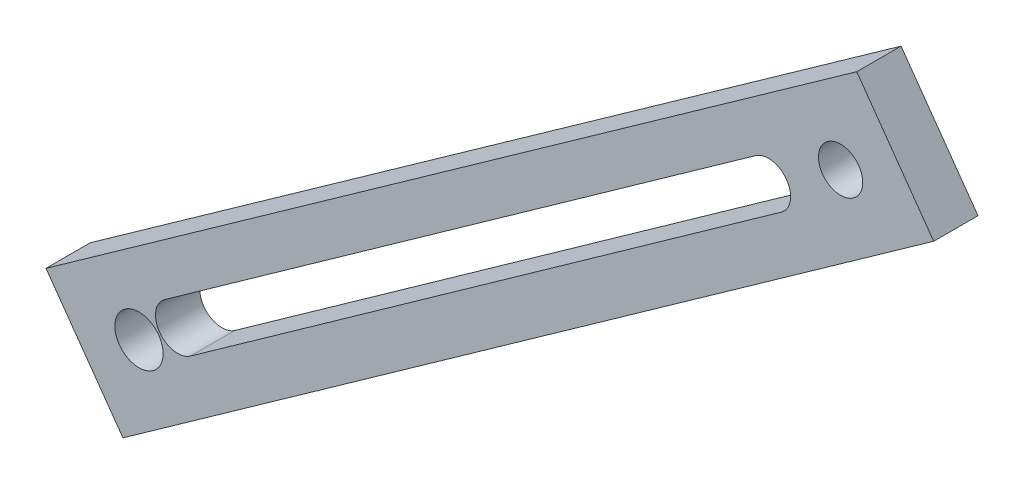
ISO-10303-21;
HEADER;
FILE_DESCRIPTION(('STEP AP214'),'2;1');
FILE_NAME('part.step','',(''),(''),'','','');
FILE_SCHEMA(('AUTOMOTIVE_DESIGN { 1 0 10303 214 1 1 1 1 }'));
ENDSEC;
DATA;
#1=APPLICATION_CONTEXT('core data for automotive mechanical design processes');
#2=APPLICATION_PROTOCOL_DEFINITION('international standard','automotive_design',2000,#1);
#3=PRODUCT_CONTEXT('',#1,'mechanical');
#4=PRODUCT('Part','Part','',(#3));
#5=PRODUCT_RELATED_PRODUCT_CATEGORY('part','',(#4));
#6=PRODUCT_DEFINITION_FORMATION('','',#4);
#7=PRODUCT_DEFINITION_CONTEXT('part definition',#1,'design');
#8=PRODUCT_DEFINITION('design','',#6,#7);
#9=PRODUCT_DEFINITION_SHAPE('','',#8);
#10=(LENGTH_UNIT() NAMED_UNIT(*) SI_UNIT(.MILLI.,.METRE.));
#11=(NAMED_UNIT(*) PLANE_ANGLE_UNIT() SI_UNIT($,.RADIAN.));
#12=(NAMED_UNIT(*) SI_UNIT($,.STERADIAN.) SOLID_ANGLE_UNIT());
#13=UNCERTAINTY_MEASURE_WITH_UNIT(LENGTH_MEASURE(1.E-05),#10,'distance_accuracy_value','');
#14=(GEOMETRIC_REPRESENTATION_CONTEXT(3) GLOBAL_UNCERTAINTY_ASSIGNED_CONTEXT((#13)) GLOBAL_UNIT_ASSIGNED_CONTEXT((#10,
#11,#12)) REPRESENTATION_CONTEXT('',''));
#15=CARTESIAN_POINT('',(0.,0.,0.));
#16=DIRECTION('',(0.,0.,1.));
#17=DIRECTION('',(1.,0.,0.));
#18=AXIS2_PLACEMENT_3D('',#15,#16,#17);
#19=CARTESIAN_POINT('',(0.,0.,0.));
#20=DIRECTION('',(0.,0.,1.));
#21=DIRECTION('',(1.,0.,0.));
#22=AXIS2_PLACEMENT_3D('',#19,#20,#21);
#23=PLANE('',#22);
#24=DIRECTION('',(-0.815023255558015,-0.579428246549661,0.));
#25=VECTOR('',#24,1.);
#26=CARTESIAN_POINT('',(-25.3493932167899,35.6564339225696,0.));
#27=LINE('',#26,#25);
#28=CARTESIAN_POINT('',(-34.9371668129383,28.8401537670692,0.));
#29=VERTEX_POINT('',#28);
#30=CARTESIAN_POINT('',(-68.8094611037688,4.75916717716821,0.));
#31=VERTEX_POINT('',#30);
#32=EDGE_CURVE('E120',#29,#31,#27,.T.);
#33=ORIENTED_EDGE('',*,*,#32,.T.);
#34=CARTESIAN_POINT('',(-68.0735872306507,3.72408764260952,0.));
#35=DIRECTION('',(0.,0.,1.));
#36=DIRECTION('',(1.,0.,0.));
#37=AXIS2_PLACEMENT_3D('',#34,#35,#36);
#38=CIRCLE('',#37,1.27000000000001);
#39=CARTESIAN_POINT('',(-67.3377133575326,2.68900810805084,0.));
#40=VERTEX_POINT('',#39);
#41=EDGE_CURVE('E141',#31,#40,#38,.T.);
#42=ORIENTED_EDGE('',*,*,#41,.T.);
#43=DIRECTION('',(-0.815023255558015,-0.579428246549661,0.));
#44=VECTOR('',#43,1.);
#45=CARTESIAN_POINT('',(-23.8776454705537,33.5862748534522,0.));
#46=LINE('',#45,#44);
#47=CARTESIAN_POINT('',(-33.4654190667021,26.7699946979518,0.));
#48=VERTEX_POINT('',#47);
#49=EDGE_CURVE('E139',#48,#40,#46,.T.);
#50=ORIENTED_EDGE('',*,*,#49,.F.);
#51=CARTESIAN_POINT('',(-34.2012929398202,27.8050742325105,0.));
#52=DIRECTION('',(0.,0.,1.));
#53=DIRECTION('',(1.,0.,0.));
#54=AXIS2_PLACEMENT_3D('',#51,#52,#53);
#55=CIRCLE('',#54,1.27);
#56=EDGE_CURVE('E125',#48,#29,#55,.T.);
#57=ORIENTED_EDGE('',*,*,#56,.T.);
#58=EDGE_LOOP('',(#33,#42,#50,#57));
#59=FACE_BOUND('',#58,.T.);
#60=CARTESIAN_POINT('',(-30.0655137022091,30.5759158934766,0.));
#61=DIRECTION('',(0.,0.,1.));
#62=DIRECTION('',(1.,0.,0.));
#63=AXIS2_PLACEMENT_3D('',#60,#61,#62);
#64=CIRCLE('',#63,1.27);
#65=CARTESIAN_POINT('',(-28.7955137022091,30.5759158934766,0.));
#66=VERTEX_POINT('',#65);
#67=EDGE_CURVE('E147',#66,#66,#64,.T.);
#68=ORIENTED_EDGE('',*,*,#67,.T.);
#69=EDGE_LOOP('',(#68));
#70=FACE_BOUND('',#69,.T.);
#71=CARTESIAN_POINT('',(-70.2885296024736,2.01757460428882,0.));
#72=DIRECTION('',(0.,0.,1.));
#73=DIRECTION('',(1.,0.,0.));
#74=AXIS2_PLACEMENT_3D('',#71,#72,#73);
#75=CIRCLE('',#74,1.38483853058884);
#76=CARTESIAN_POINT('',(-68.9036910718848,2.01757460428882,0.));
#77=VERTEX_POINT('',#76);
#78=EDGE_CURVE('E146',#77,#77,#75,.T.);
#79=ORIENTED_EDGE('',*,*,#78,.T.);
#80=EDGE_LOOP('',(#79));
#81=FACE_BOUND('',#80,.T.);
#82=DIRECTION('',(0.815382984620276,0.578921919080397,0.));
#83=VECTOR('',#82,1.);
#84=CARTESIAN_POINT('',(-22.3039316766237,31.4139882769347,0.));
#85=LINE('',#84,#83);
#86=CARTESIAN_POINT('',(-71.2084404619896,-3.3082129606752,0.));
#87=VERTEX_POINT('',#86);
#88=CARTESIAN_POINT('',(-24.7283543478885,29.6926481803367,0.));
#89=VERTEX_POINT('',#88);
#90=EDGE_CURVE('E150',#87,#89,#85,.T.);
#91=ORIENTED_EDGE('',*,*,#90,.F.);
#92=DIRECTION('',(0.578921919080397,-0.815382984620277,0.));
#93=VECTOR('',#92,1.);
#94=CARTESIAN_POINT('',(-48.904508785366,-34.7222012376099,0.));
#95=LINE('',#94,#93);
#96=CARTESIAN_POINT('',(-75.6198254853822,2.9050053821313,0.));
#97=VERTEX_POINT('',#96);
#98=EDGE_CURVE('E163',#97,#87,#95,.T.);
#99=ORIENTED_EDGE('',*,*,#98,.F.);
#100=DIRECTION('',(0.815382984620277,0.578921919080397,0.));
#101=VECTOR('',#100,1.);
#102=CARTESIAN_POINT('',(-26.7153167000162,37.6272066197412,0.));
#103=LINE('',#102,#101);
#104=CARTESIAN_POINT('',(-29.1397393712811,35.9058665231431,0.));
#105=VERTEX_POINT('',#104);
#106=EDGE_CURVE('E176',#97,#105,#103,.T.);
#107=ORIENTED_EDGE('',*,*,#106,.T.);
#108=DIRECTION('',(-0.578921919080397,0.815382984620276,0.));
#109=VECTOR('',#108,1.);
#110=CARTESIAN_POINT('',(-2.42442267126478,-1.721340096598,0.));
#111=LINE('',#110,#109);
#112=EDGE_CURVE('E173',#89,#105,#111,.T.);
#113=ORIENTED_EDGE('',*,*,#112,.F.);
#114=EDGE_LOOP('',(#91,#99,#107,#113));
#115=FACE_BOUND('',#114,.T.);
#116=ADVANCED_FACE('F59',(#59,#70,#81,#115),#23,.F.);
#117=CARTESIAN_POINT('',(-48.904508785366,-34.7222012376099,2.54));
#118=DIRECTION('',(0.815382984620277,0.578921919080397,0.));
#119=DIRECTION('',(-0.578921919080397,0.815382984620277,0.));
#120=AXIS2_PLACEMENT_3D('',#117,#118,#119);
#121=PLANE('',#120);
#122=ORIENTED_EDGE('',*,*,#98,.T.);
#123=DIRECTION('',(0.,0.,-1.));
#124=VECTOR('',#123,1.);
#125=CARTESIAN_POINT('',(-71.2084404619896,-3.3082129606752,2.54));
#126=LINE('',#125,#124);
#127=CARTESIAN_POINT('',(-71.2084404619896,-3.3082129606752,2.54));
#128=VERTEX_POINT('',#127);
#129=EDGE_CURVE('E170',#128,#87,#126,.T.);
#130=ORIENTED_EDGE('',*,*,#129,.F.);
#131=DIRECTION('',(0.578921919080397,-0.815382984620277,0.));
#132=VECTOR('',#131,1.);
#133=CARTESIAN_POINT('',(-48.904508785366,-34.7222012376099,2.54));
#134=LINE('',#133,#132);
#135=CARTESIAN_POINT('',(-75.6198254853822,2.9050053821313,2.54));
#136=VERTEX_POINT('',#135);
#137=EDGE_CURVE('E168',#136,#128,#134,.T.);
#138=ORIENTED_EDGE('',*,*,#137,.F.);
#139=DIRECTION('',(0.,0.,-1.));
#140=VECTOR('',#139,1.);
#141=CARTESIAN_POINT('',(-75.6198254853822,2.9050053821313,2.54));
#142=LINE('',#141,#140);
#143=EDGE_CURVE('E182',#136,#97,#142,.T.);
#144=ORIENTED_EDGE('',*,*,#143,.T.);
#145=EDGE_LOOP('',(#122,#130,#138,#144));
#146=FACE_BOUND('',#145,.T.);
#147=ADVANCED_FACE('F216',(#146),#121,.F.);
#148=CARTESIAN_POINT('',(-26.7153167000162,37.6272066197412,2.54));
#149=DIRECTION('',(-0.578921919080397,0.815382984620277,0.));
#150=DIRECTION('',(-0.815382984620277,-0.578921919080397,0.));
#151=AXIS2_PLACEMENT_3D('',#148,#149,#150);
#152=PLANE('',#151);
#153=ORIENTED_EDGE('',*,*,#106,.F.);
#154=ORIENTED_EDGE('',*,*,#143,.F.);
#155=DIRECTION('',(0.815382984620277,0.578921919080397,0.));
#156=VECTOR('',#155,1.);
#157=CARTESIAN_POINT('',(-26.7153167000162,37.6272066197412,2.54));
#158=LINE('',#157,#156);
#159=CARTESIAN_POINT('',(-29.1397393712811,35.9058665231431,2.54));
#160=VERTEX_POINT('',#159);
#161=EDGE_CURVE('E165',#136,#160,#158,.T.);
#162=ORIENTED_EDGE('',*,*,#161,.T.);
#163=DIRECTION('',(0.,0.,-1.));
#164=VECTOR('',#163,1.);
#165=CARTESIAN_POINT('',(-29.1397393712811,35.9058665231431,2.54));
#166=LINE('',#165,#164);
#167=EDGE_CURVE('E184',#160,#105,#166,.T.);
#168=ORIENTED_EDGE('',*,*,#167,.T.);
#169=EDGE_LOOP('',(#153,#154,#162,#168));
#170=FACE_BOUND('',#169,.T.);
#171=ADVANCED_FACE('F218',(#170),#152,.T.);
#172=CARTESIAN_POINT('',(-2.42442267126478,-1.721340096598,2.54));
#173=DIRECTION('',(-0.815382984620276,-0.578921919080398,0.));
#174=DIRECTION('',(0.578921919080397,-0.815382984620276,0.));
#175=AXIS2_PLACEMENT_3D('',#172,#173,#174);
#176=PLANE('',#175);
#177=ORIENTED_EDGE('',*,*,#112,.T.);
#178=ORIENTED_EDGE('',*,*,#167,.F.);
#179=DIRECTION('',(-0.578921919080397,0.815382984620276,0.));
#180=VECTOR('',#179,1.);
#181=CARTESIAN_POINT('',(-2.42442267126478,-1.721340096598,2.54));
#182=LINE('',#181,#180);
#183=CARTESIAN_POINT('',(-24.7283543478885,29.6926481803367,2.54));
#184=VERTEX_POINT('',#183);
#185=EDGE_CURVE('E162',#184,#160,#182,.T.);
#186=ORIENTED_EDGE('',*,*,#185,.F.);
#187=DIRECTION('',(0.,0.,-1.));
#188=VECTOR('',#187,1.);
#189=CARTESIAN_POINT('',(-24.7283543478885,29.6926481803367,2.54));
#190=LINE('',#189,#188);
#191=EDGE_CURVE('E186',#184,#89,#190,.T.);
#192=ORIENTED_EDGE('',*,*,#191,.T.);
#193=EDGE_LOOP('',(#177,#178,#186,#192));
#194=FACE_BOUND('',#193,.T.);
#195=ADVANCED_FACE('F225',(#194),#176,.F.);
#196=CARTESIAN_POINT('',(-22.3039316766237,31.4139882769347,2.54));
#197=DIRECTION('',(-0.578921919080397,0.815382984620276,0.));
#198=DIRECTION('',(-0.815382984620277,-0.578921919080397,0.));
#199=AXIS2_PLACEMENT_3D('',#196,#197,#198);
#200=PLANE('',#199);
#201=ORIENTED_EDGE('',*,*,#90,.T.);
#202=ORIENTED_EDGE('',*,*,#191,.F.);
#203=DIRECTION('',(0.815382984620276,0.578921919080397,0.));
#204=VECTOR('',#203,1.);
#205=CARTESIAN_POINT('',(-22.3039316766237,31.4139882769347,2.54));
#206=LINE('',#205,#204);
#207=EDGE_CURVE('E159',#128,#184,#206,.T.);
#208=ORIENTED_EDGE('',*,*,#207,.F.);
#209=ORIENTED_EDGE('',*,*,#129,.T.);
#210=EDGE_LOOP('',(#201,#202,#208,#209));
#211=FACE_BOUND('',#210,.T.);
#212=ADVANCED_FACE('F61',(#211),#200,.F.);
#213=CARTESIAN_POINT('',(0.,0.,2.54));
#214=DIRECTION('',(0.,0.,1.));
#215=DIRECTION('',(1.,0.,0.));
#216=AXIS2_PLACEMENT_3D('',#213,#214,#215);
#217=PLANE('',#216);
#218=CARTESIAN_POINT('',(-68.0735872306507,3.72408764260952,2.54));
#219=DIRECTION('',(0.,0.,1.));
#220=DIRECTION('',(1.,0.,0.));
#221=AXIS2_PLACEMENT_3D('',#218,#219,#220);
#222=CIRCLE('',#221,1.27000000000001);
#223=CARTESIAN_POINT('',(-68.8094611037688,4.75916717716821,2.54));
#224=VERTEX_POINT('',#223);
#225=CARTESIAN_POINT('',(-67.3377133575326,2.68900810805084,2.54));
#226=VERTEX_POINT('',#225);
#227=EDGE_CURVE('E12',#224,#226,#222,.T.);
#228=ORIENTED_EDGE('',*,*,#227,.F.);
#229=DIRECTION('',(-0.815023255558015,-0.579428246549661,0.));
#230=VECTOR('',#229,1.);
#231=CARTESIAN_POINT('',(-25.3493932167899,35.6564339225696,2.54));
#232=LINE('',#231,#230);
#233=CARTESIAN_POINT('',(-34.9371668129383,28.8401537670692,2.54));
#234=VERTEX_POINT('',#233);
#235=EDGE_CURVE('E189',#234,#224,#232,.T.);
#236=ORIENTED_EDGE('',*,*,#235,.F.);
#237=CARTESIAN_POINT('',(-34.2012929398202,27.8050742325105,2.54));
#238=DIRECTION('',(0.,0.,1.));
#239=DIRECTION('',(1.,0.,0.));
#240=AXIS2_PLACEMENT_3D('',#237,#238,#239);
#241=CIRCLE('',#240,1.27);
#242=CARTESIAN_POINT('',(-33.4654190667021,26.7699946979518,2.54));
#243=VERTEX_POINT('',#242);
#244=EDGE_CURVE('E133',#243,#234,#241,.T.);
#245=ORIENTED_EDGE('',*,*,#244,.F.);
#246=DIRECTION('',(-0.815023255558015,-0.579428246549661,0.));
#247=VECTOR('',#246,1.);
#248=CARTESIAN_POINT('',(-23.8776454705537,33.5862748534522,2.54));
#249=LINE('',#248,#247);
#250=EDGE_CURVE('E67',#243,#226,#249,.T.);
#251=ORIENTED_EDGE('',*,*,#250,.T.);
#252=EDGE_LOOP('',(#228,#236,#245,#251));
#253=FACE_BOUND('',#252,.T.);
#254=CARTESIAN_POINT('',(-30.0655137022091,30.5759158934766,2.54));
#255=DIRECTION('',(0.,0.,1.));
#256=DIRECTION('',(1.,0.,0.));
#257=AXIS2_PLACEMENT_3D('',#254,#255,#256);
#258=CIRCLE('',#257,1.27);
#259=CARTESIAN_POINT('',(-28.7955137022091,30.5759158934766,2.54));
#260=VERTEX_POINT('',#259);
#261=EDGE_CURVE('E151',#260,#260,#258,.T.);
#262=ORIENTED_EDGE('',*,*,#261,.F.);
#263=EDGE_LOOP('',(#262));
#264=FACE_BOUND('',#263,.T.);
#265=CARTESIAN_POINT('',(-70.2885296024736,2.01757460428882,2.54));
#266=DIRECTION('',(0.,0.,1.));
#267=DIRECTION('',(1.,0.,0.));
#268=AXIS2_PLACEMENT_3D('',#265,#266,#267);
#269=CIRCLE('',#268,1.38483853058884);
#270=CARTESIAN_POINT('',(-68.9036910718848,2.01757460428882,2.54));
#271=VERTEX_POINT('',#270);
#272=EDGE_CURVE('E154',#271,#271,#269,.T.);
#273=ORIENTED_EDGE('',*,*,#272,.F.);
#274=EDGE_LOOP('',(#273));
#275=FACE_BOUND('',#274,.T.);
#276=ORIENTED_EDGE('',*,*,#207,.T.);
#277=ORIENTED_EDGE('',*,*,#185,.T.);
#278=ORIENTED_EDGE('',*,*,#161,.F.);
#279=ORIENTED_EDGE('',*,*,#137,.T.);
#280=EDGE_LOOP('',(#276,#277,#278,#279));
#281=FACE_BOUND('',#280,.T.);
#282=ADVANCED_FACE('F194',(#253,#264,#275,#281),#217,.T.);
#283=CARTESIAN_POINT('',(-70.2885296024736,2.01757460428882,0.));
#284=DIRECTION('',(0.,0.,1.));
#285=DIRECTION('',(1.,0.,0.));
#286=AXIS2_PLACEMENT_3D('',#283,#284,#285);
#287=CYLINDRICAL_SURFACE('',#286,1.38483853058884);
#288=ORIENTED_EDGE('',*,*,#78,.F.);
#289=EDGE_LOOP('',(#288));
#290=FACE_BOUND('',#289,.T.);
#291=ORIENTED_EDGE('',*,*,#272,.T.);
#292=EDGE_LOOP('',(#291));
#293=FACE_BOUND('',#292,.T.);
#294=ADVANCED_FACE('F212',(#290,#293),#287,.F.);
#295=CARTESIAN_POINT('',(-30.0655137022091,30.5759158934766,0.));
#296=DIRECTION('',(0.,0.,1.));
#297=DIRECTION('',(1.,0.,0.));
#298=AXIS2_PLACEMENT_3D('',#295,#296,#297);
#299=CYLINDRICAL_SURFACE('',#298,1.27);
#300=ORIENTED_EDGE('',*,*,#67,.F.);
#301=EDGE_LOOP('',(#300));
#302=FACE_BOUND('',#301,.T.);
#303=ORIENTED_EDGE('',*,*,#261,.T.);
#304=EDGE_LOOP('',(#303));
#305=FACE_BOUND('',#304,.T.);
#306=ADVANCED_FACE('F205',(#302,#305),#299,.F.);
#307=CARTESIAN_POINT('',(-68.0735872306507,3.72408764260952,10.16));
#308=DIRECTION('',(0.,0.,-1.));
#309=DIRECTION('',(-1.,0.,0.));
#310=AXIS2_PLACEMENT_3D('',#307,#308,#309);
#311=CYLINDRICAL_SURFACE('',#310,1.27000000000001);
#312=DIRECTION('',(0.,0.,-1.));
#313=VECTOR('',#312,1.);
#314=CARTESIAN_POINT('',(-68.8094611037688,4.75916717716821,10.16));
#315=LINE('',#314,#313);
#316=EDGE_CURVE('E74',#224,#31,#315,.T.);
#317=ORIENTED_EDGE('',*,*,#316,.F.);
#318=ORIENTED_EDGE('',*,*,#227,.T.);
#319=DIRECTION('',(0.,0.,-1.));
#320=VECTOR('',#319,1.);
#321=CARTESIAN_POINT('',(-67.3377133575326,2.68900810805084,10.16));
#322=LINE('',#321,#320);
#323=EDGE_CURVE('E126',#226,#40,#322,.T.);
#324=ORIENTED_EDGE('',*,*,#323,.T.);
#325=ORIENTED_EDGE('',*,*,#41,.F.);
#326=EDGE_LOOP('',(#317,#318,#324,#325));
#327=FACE_BOUND('',#326,.T.);
#328=ADVANCED_FACE('F203',(#327),#311,.F.);
#329=CARTESIAN_POINT('',(-67.3377133575326,2.68900810805084,10.16));
#330=DIRECTION('',(-0.579428246549661,0.815023255558015,0.));
#331=DIRECTION('',(-0.815023255558015,-0.579428246549661,0.));
#332=AXIS2_PLACEMENT_3D('',#329,#330,#331);
#333=PLANE('',#332);
#334=ORIENTED_EDGE('',*,*,#49,.T.);
#335=ORIENTED_EDGE('',*,*,#323,.F.);
#336=ORIENTED_EDGE('',*,*,#250,.F.);
#337=DIRECTION('',(0.,0.,-1.));
#338=VECTOR('',#337,1.);
#339=CARTESIAN_POINT('',(-33.4654190667021,26.7699946979518,10.16));
#340=LINE('',#339,#338);
#341=EDGE_CURVE('E135',#243,#48,#340,.T.);
#342=ORIENTED_EDGE('',*,*,#341,.T.);
#343=EDGE_LOOP('',(#334,#335,#336,#342));
#344=FACE_BOUND('',#343,.T.);
#345=ADVANCED_FACE('F198',(#344),#333,.T.);
#346=CARTESIAN_POINT('',(-34.2012929398202,27.8050742325105,10.16));
#347=DIRECTION('',(0.,0.,-1.));
#348=DIRECTION('',(-1.,0.,0.));
#349=AXIS2_PLACEMENT_3D('',#346,#347,#348);
#350=CYLINDRICAL_SURFACE('',#349,1.27);
#351=ORIENTED_EDGE('',*,*,#341,.F.);
#352=ORIENTED_EDGE('',*,*,#244,.T.);
#353=DIRECTION('',(0.,0.,-1.));
#354=VECTOR('',#353,1.);
#355=CARTESIAN_POINT('',(-34.9371668129383,28.8401537670692,10.16));
#356=LINE('',#355,#354);
#357=EDGE_CURVE('E79',#234,#29,#356,.T.);
#358=ORIENTED_EDGE('',*,*,#357,.T.);
#359=ORIENTED_EDGE('',*,*,#56,.F.);
#360=EDGE_LOOP('',(#351,#352,#358,#359));
#361=FACE_BOUND('',#360,.T.);
#362=ADVANCED_FACE('F130',(#361),#350,.F.);
#363=CARTESIAN_POINT('',(-68.8094611037688,4.75916717716821,10.16));
#364=DIRECTION('',(-0.579428246549661,0.815023255558015,0.));
#365=DIRECTION('',(-0.815023255558015,-0.579428246549661,0.));
#366=AXIS2_PLACEMENT_3D('',#363,#364,#365);
#367=PLANE('',#366);
#368=ORIENTED_EDGE('',*,*,#357,.F.);
#369=ORIENTED_EDGE('',*,*,#235,.T.);
#370=ORIENTED_EDGE('',*,*,#316,.T.);
#371=ORIENTED_EDGE('',*,*,#32,.F.);
#372=EDGE_LOOP('',(#368,#369,#370,#371));
#373=FACE_BOUND('',#372,.T.);
#374=ADVANCED_FACE('F121',(#373),#367,.F.);
#375=CLOSED_SHELL('',(#116,#147,#171,#195,#212,#282,#294,#306,#328,#345,#362,#374));
#376=MANIFOLD_SOLID_BREP('B2',#375);
#377=ADVANCED_BREP_SHAPE_REPRESENTATION('',(#18,#376),#14);
#378=SHAPE_DEFINITION_REPRESENTATION(#9,#377);
ENDSEC;
END-ISO-10303-21;
